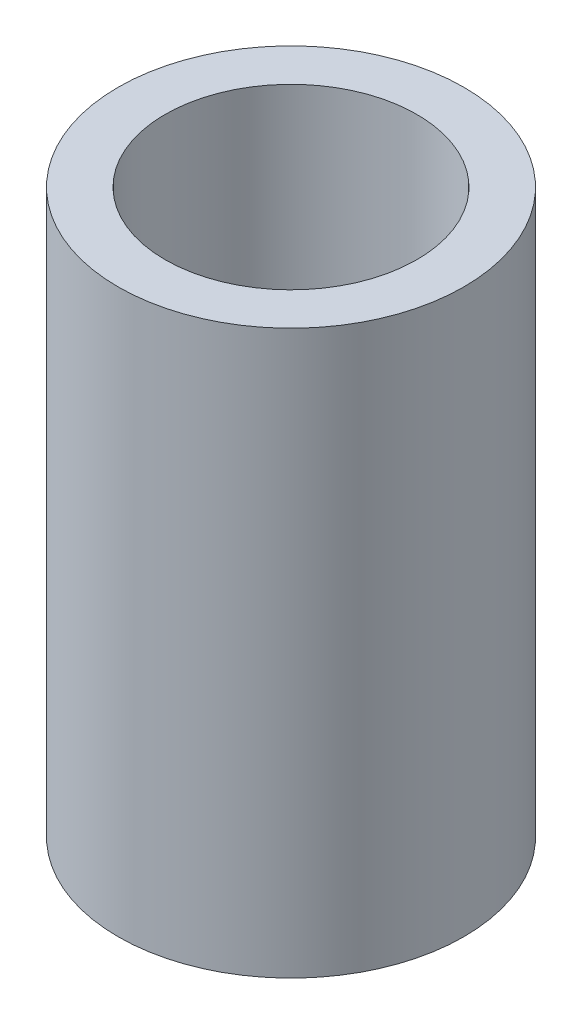
ISO-10303-21;
HEADER;
FILE_DESCRIPTION(('STEP AP214'),'2;1');
FILE_NAME('part.step','',(''),(''),'','','');
FILE_SCHEMA(('AUTOMOTIVE_DESIGN { 1 0 10303 214 1 1 1 1 }'));
ENDSEC;
DATA;
#1=APPLICATION_CONTEXT('core data for automotive mechanical design processes');
#2=APPLICATION_PROTOCOL_DEFINITION('international standard','automotive_design',2000,#1);
#3=PRODUCT_CONTEXT('',#1,'mechanical');
#4=PRODUCT('Part','Part','',(#3));
#5=PRODUCT_RELATED_PRODUCT_CATEGORY('part','',(#4));
#6=PRODUCT_DEFINITION_FORMATION('','',#4);
#7=PRODUCT_DEFINITION_CONTEXT('part definition',#1,'design');
#8=PRODUCT_DEFINITION('design','',#6,#7);
#9=PRODUCT_DEFINITION_SHAPE('','',#8);
#10=(LENGTH_UNIT() NAMED_UNIT(*) SI_UNIT(.MILLI.,.METRE.));
#11=(NAMED_UNIT(*) PLANE_ANGLE_UNIT() SI_UNIT($,.RADIAN.));
#12=(NAMED_UNIT(*) SI_UNIT($,.STERADIAN.) SOLID_ANGLE_UNIT());
#13=UNCERTAINTY_MEASURE_WITH_UNIT(LENGTH_MEASURE(1.E-05),#10,'distance_accuracy_value','');
#14=(GEOMETRIC_REPRESENTATION_CONTEXT(3) GLOBAL_UNCERTAINTY_ASSIGNED_CONTEXT((#13)) GLOBAL_UNIT_ASSIGNED_CONTEXT((#10,
#11,#12)) REPRESENTATION_CONTEXT('',''));
#15=CARTESIAN_POINT('',(0.,0.,0.));
#16=DIRECTION('',(0.,0.,1.));
#17=DIRECTION('',(1.,0.,0.));
#18=AXIS2_PLACEMENT_3D('',#15,#16,#17);
#19=CARTESIAN_POINT('',(0.,65.1001414218729,0.));
#20=DIRECTION('',(0.,-1.,0.));
#21=DIRECTION('',(0.,0.,-1.));
#22=AXIS2_PLACEMENT_3D('',#19,#20,#21);
#23=CYLINDRICAL_SURFACE('',#22,20.);
#24=CARTESIAN_POINT('',(0.,65.1001414218729,0.));
#25=DIRECTION('',(0.,1.,0.));
#26=DIRECTION('',(0.,0.,1.));
#27=AXIS2_PLACEMENT_3D('',#24,#25,#26);
#28=CIRCLE('',#27,20.);
#29=CARTESIAN_POINT('',(0.,65.1001414218729,20.));
#30=VERTEX_POINT('',#29);
#31=EDGE_CURVE('E10',#30,#30,#28,.T.);
#32=ORIENTED_EDGE('',*,*,#31,.F.);
#33=EDGE_LOOP('',(#32));
#34=FACE_BOUND('',#33,.T.);
#35=CARTESIAN_POINT('',(0.,0.,0.));
#36=DIRECTION('',(0.,1.,0.));
#37=DIRECTION('',(0.,0.,1.));
#38=AXIS2_PLACEMENT_3D('',#35,#36,#37);
#39=CIRCLE('',#38,20.);
#40=CARTESIAN_POINT('',(0.,0.,20.));
#41=VERTEX_POINT('',#40);
#42=EDGE_CURVE('E37',#41,#41,#39,.T.);
#43=ORIENTED_EDGE('',*,*,#42,.T.);
#44=EDGE_LOOP('',(#43));
#45=FACE_BOUND('',#44,.T.);
#46=ADVANCED_FACE('F40',(#34,#45),#23,.T.);
#47=CARTESIAN_POINT('',(0.,65.1001414218729,0.));
#48=DIRECTION('',(0.,1.,0.));
#49=DIRECTION('',(0.,0.,1.));
#50=AXIS2_PLACEMENT_3D('',#47,#48,#49);
#51=PLANE('',#50);
#52=CARTESIAN_POINT('',(0.,65.1001414218729,0.));
#53=DIRECTION('',(0.,1.,0.));
#54=DIRECTION('',(0.,0.,1.));
#55=AXIS2_PLACEMENT_3D('',#52,#53,#54);
#56=CIRCLE('',#55,14.560455121069);
#57=CARTESIAN_POINT('',(0.,65.1001414218729,14.560455121069));
#58=VERTEX_POINT('',#57);
#59=EDGE_CURVE('E50',#58,#58,#56,.T.);
#60=ORIENTED_EDGE('',*,*,#59,.F.);
#61=EDGE_LOOP('',(#60));
#62=FACE_BOUND('',#61,.T.);
#63=ORIENTED_EDGE('',*,*,#31,.T.);
#64=EDGE_LOOP('',(#63));
#65=FACE_BOUND('',#64,.T.);
#66=ADVANCED_FACE('F59',(#62,#65),#51,.T.);
#67=CARTESIAN_POINT('',(0.,0.,0.));
#68=DIRECTION('',(0.,1.,0.));
#69=DIRECTION('',(0.,0.,1.));
#70=AXIS2_PLACEMENT_3D('',#67,#68,#69);
#71=PLANE('',#70);
#72=CARTESIAN_POINT('',(0.,0.,0.));
#73=DIRECTION('',(0.,1.,0.));
#74=DIRECTION('',(0.,0.,1.));
#75=AXIS2_PLACEMENT_3D('',#72,#73,#74);
#76=CIRCLE('',#75,14.560455121069);
#77=CARTESIAN_POINT('',(0.,0.,14.560455121069));
#78=VERTEX_POINT('',#77);
#79=EDGE_CURVE('E47',#78,#78,#76,.T.);
#80=ORIENTED_EDGE('',*,*,#79,.T.);
#81=EDGE_LOOP('',(#80));
#82=FACE_BOUND('',#81,.T.);
#83=ORIENTED_EDGE('',*,*,#42,.F.);
#84=EDGE_LOOP('',(#83));
#85=FACE_BOUND('',#84,.T.);
#86=ADVANCED_FACE('F58',(#82,#85),#71,.F.);
#87=CARTESIAN_POINT('',(0.,65.1001414218729,0.));
#88=DIRECTION('',(0.,-1.,0.));
#89=DIRECTION('',(0.,0.,-1.));
#90=AXIS2_PLACEMENT_3D('',#87,#88,#89);
#91=CYLINDRICAL_SURFACE('',#90,14.560455121069);
#92=ORIENTED_EDGE('',*,*,#59,.T.);
#93=EDGE_LOOP('',(#92));
#94=FACE_BOUND('',#93,.T.);
#95=ORIENTED_EDGE('',*,*,#79,.F.);
#96=EDGE_LOOP('',(#95));
#97=FACE_BOUND('',#96,.T.);
#98=ADVANCED_FACE('F54',(#94,#97),#91,.F.);
#99=CLOSED_SHELL('',(#46,#66,#86,#98));
#100=MANIFOLD_SOLID_BREP('B2',#99);
#101=ADVANCED_BREP_SHAPE_REPRESENTATION('',(#18,#100),#14);
#102=SHAPE_DEFINITION_REPRESENTATION(#9,#101);
ENDSEC;
END-ISO-10303-21;
